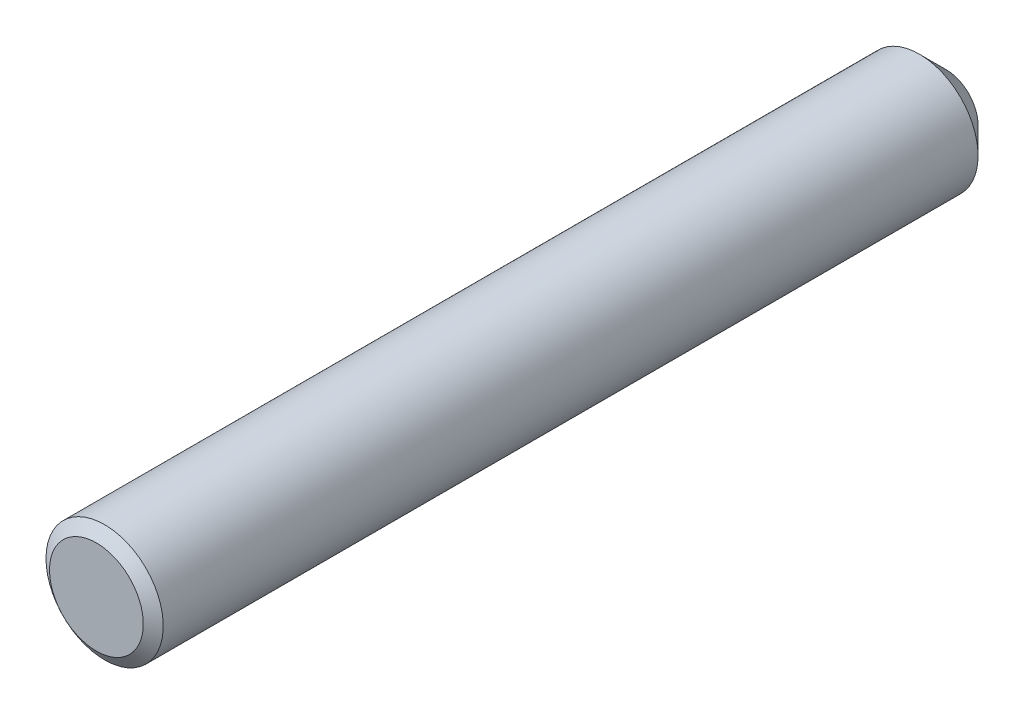
ISO-10303-21;
HEADER;
FILE_DESCRIPTION(('STEP AP214'),'2;1');
FILE_NAME('part.step','',(''),(''),'','','');
FILE_SCHEMA(('AUTOMOTIVE_DESIGN { 1 0 10303 214 1 1 1 1 }'));
ENDSEC;
DATA;
#1=APPLICATION_CONTEXT('core data for automotive mechanical design processes');
#2=APPLICATION_PROTOCOL_DEFINITION('international standard','automotive_design',2000,#1);
#3=PRODUCT_CONTEXT('',#1,'mechanical');
#4=PRODUCT('Part','Part','',(#3));
#5=PRODUCT_RELATED_PRODUCT_CATEGORY('part','',(#4));
#6=PRODUCT_DEFINITION_FORMATION('','',#4);
#7=PRODUCT_DEFINITION_CONTEXT('part definition',#1,'design');
#8=PRODUCT_DEFINITION('design','',#6,#7);
#9=PRODUCT_DEFINITION_SHAPE('','',#8);
#10=(LENGTH_UNIT() NAMED_UNIT(*) SI_UNIT(.MILLI.,.METRE.));
#11=(NAMED_UNIT(*) PLANE_ANGLE_UNIT() SI_UNIT($,.RADIAN.));
#12=(NAMED_UNIT(*) SI_UNIT($,.STERADIAN.) SOLID_ANGLE_UNIT());
#13=UNCERTAINTY_MEASURE_WITH_UNIT(LENGTH_MEASURE(1.E-05),#10,'distance_accuracy_value','');
#14=(GEOMETRIC_REPRESENTATION_CONTEXT(3) GLOBAL_UNCERTAINTY_ASSIGNED_CONTEXT((#13)) GLOBAL_UNIT_ASSIGNED_CONTEXT((#10,
#11,#12)) REPRESENTATION_CONTEXT('',''));
#15=CARTESIAN_POINT('',(0.,0.,0.));
#16=DIRECTION('',(0.,0.,1.));
#17=DIRECTION('',(1.,0.,0.));
#18=AXIS2_PLACEMENT_3D('',#15,#16,#17);
#19=CARTESIAN_POINT('',(0.,0.,12.7));
#20=DIRECTION('',(0.,0.,1.));
#21=DIRECTION('',(1.,0.,0.));
#22=AXIS2_PLACEMENT_3D('',#19,#20,#21);
#23=PLANE('',#22);
#24=CARTESIAN_POINT('',(0.,0.,12.7));
#25=DIRECTION('',(0.,0.,-1.));
#26=DIRECTION('',(-1.,0.,0.));
#27=AXIS2_PLACEMENT_3D('',#24,#25,#26);
#28=CIRCLE('',#27,1.40208);
#29=CARTESIAN_POINT('',(-1.40208,0.,12.7));
#30=VERTEX_POINT('',#29);
#31=EDGE_CURVE('E10',#30,#30,#28,.T.);
#32=ORIENTED_EDGE('',*,*,#31,.F.);
#33=EDGE_LOOP('',(#32));
#34=FACE_BOUND('',#33,.T.);
#35=ADVANCED_FACE('F35',(#34),#23,.T.);
#36=CARTESIAN_POINT('',(0.,0.,12.4545632537067));
#37=DIRECTION('',(0.,0.,-1.));
#38=DIRECTION('',(-1.,0.,0.));
#39=AXIS2_PLACEMENT_3D('',#36,#37,#38);
#40=CONICAL_SURFACE('',#39,1.7526,0.95993108859688);
#41=ORIENTED_EDGE('',*,*,#31,.T.);
#42=EDGE_LOOP('',(#41));
#43=FACE_BOUND('',#42,.T.);
#44=CARTESIAN_POINT('',(0.,0.,12.4545632537067));
#45=DIRECTION('',(0.,0.,-1.));
#46=DIRECTION('',(-1.,0.,0.));
#47=AXIS2_PLACEMENT_3D('',#44,#45,#46);
#48=CIRCLE('',#47,1.7526);
#49=CARTESIAN_POINT('',(-1.7526,0.,12.4545632537067));
#50=VERTEX_POINT('',#49);
#51=EDGE_CURVE('E41',#50,#50,#48,.T.);
#52=ORIENTED_EDGE('',*,*,#51,.F.);
#53=EDGE_LOOP('',(#52));
#54=FACE_BOUND('',#53,.T.);
#55=ADVANCED_FACE('F67',(#43,#54),#40,.T.);
#56=CARTESIAN_POINT('',(0.,0.,-12.7));
#57=DIRECTION('',(0.,0.,-1.));
#58=DIRECTION('',(-1.,0.,0.));
#59=AXIS2_PLACEMENT_3D('',#56,#57,#58);
#60=CYLINDRICAL_SURFACE('',#59,1.7526);
#61=ORIENTED_EDGE('',*,*,#51,.T.);
#62=EDGE_LOOP('',(#61));
#63=FACE_BOUND('',#62,.T.);
#64=CARTESIAN_POINT('',(0.,0.,-11.90625));
#65=DIRECTION('',(0.,0.,-1.));
#66=DIRECTION('',(-1.,0.,0.));
#67=AXIS2_PLACEMENT_3D('',#64,#65,#66);
#68=CIRCLE('',#67,1.7526);
#69=CARTESIAN_POINT('',(-1.7526,0.,-11.90625));
#70=VERTEX_POINT('',#69);
#71=EDGE_CURVE('E45',#70,#70,#68,.T.);
#72=ORIENTED_EDGE('',*,*,#71,.F.);
#73=EDGE_LOOP('',(#72));
#74=FACE_BOUND('',#73,.T.);
#75=ADVANCED_FACE('F59',(#63,#74),#60,.T.);
#76=CARTESIAN_POINT('',(0.,0.,-12.7));
#77=DIRECTION('',(0.,0.,1.));
#78=DIRECTION('',(1.,0.,0.));
#79=AXIS2_PLACEMENT_3D('',#76,#77,#78);
#80=CONICAL_SURFACE('',#79,0.958850000000002,0.78539816339745);
#81=ORIENTED_EDGE('',*,*,#71,.T.);
#82=EDGE_LOOP('',(#81));
#83=FACE_BOUND('',#82,.T.);
#84=CARTESIAN_POINT('',(0.,0.,-12.7));
#85=DIRECTION('',(0.,0.,-1.));
#86=DIRECTION('',(-1.,0.,0.));
#87=AXIS2_PLACEMENT_3D('',#84,#85,#86);
#88=CIRCLE('',#87,0.958850000000002);
#89=CARTESIAN_POINT('',(-0.958850000000002,0.,-12.7));
#90=VERTEX_POINT('',#89);
#91=EDGE_CURVE('E49',#90,#90,#88,.T.);
#92=ORIENTED_EDGE('',*,*,#91,.F.);
#93=EDGE_LOOP('',(#92));
#94=FACE_BOUND('',#93,.T.);
#95=ADVANCED_FACE('F57',(#83,#94),#80,.T.);
#96=CARTESIAN_POINT('',(0.,0.,-12.7));
#97=DIRECTION('',(0.,0.,-1.));
#98=DIRECTION('',(-1.,0.,0.));
#99=AXIS2_PLACEMENT_3D('',#96,#97,#98);
#100=PLANE('',#99);
#101=ORIENTED_EDGE('',*,*,#91,.T.);
#102=EDGE_LOOP('',(#101));
#103=FACE_BOUND('',#102,.T.);
#104=ADVANCED_FACE('F55',(#103),#100,.T.);
#105=CLOSED_SHELL('',(#35,#55,#75,#95,#104));
#106=MANIFOLD_SOLID_BREP('B2',#105);
#107=ADVANCED_BREP_SHAPE_REPRESENTATION('',(#18,#106),#14);
#108=SHAPE_DEFINITION_REPRESENTATION(#9,#107);
ENDSEC;
END-ISO-10303-21;
